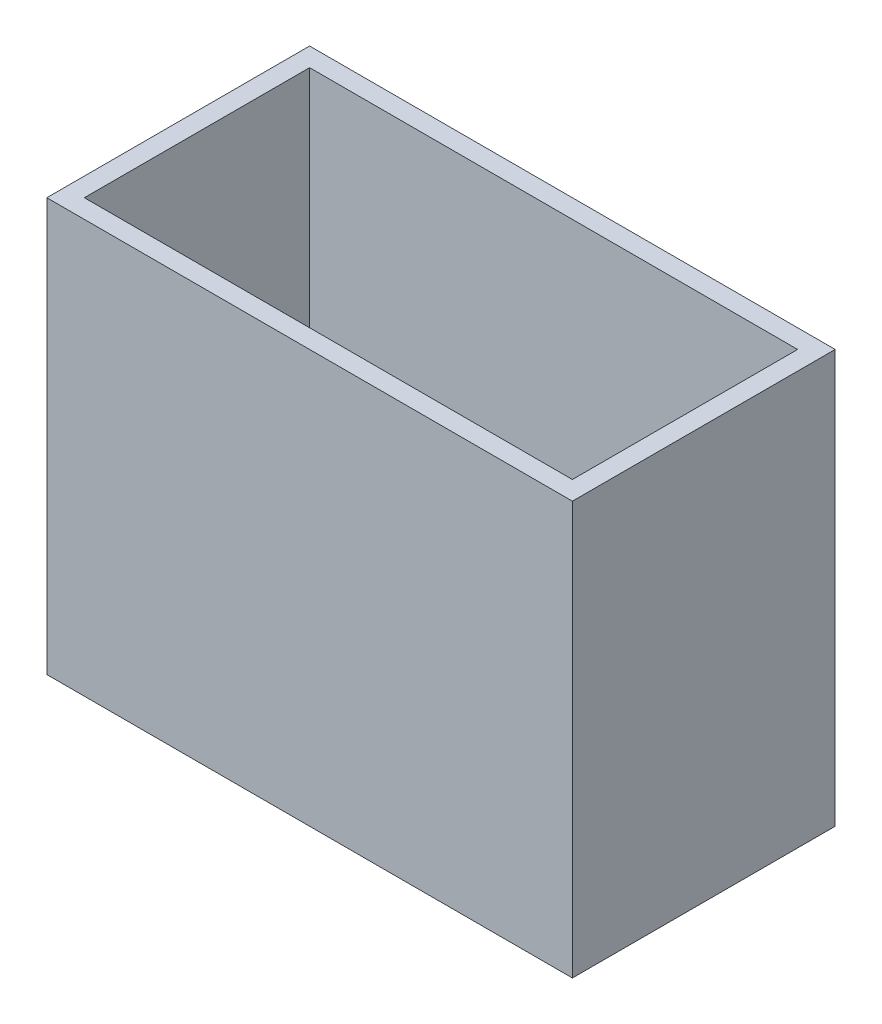
ISO-10303-21;
HEADER;
FILE_DESCRIPTION(('STEP AP214'),'2;1');
FILE_NAME('part.step','',(''),(''),'','','');
FILE_SCHEMA(('AUTOMOTIVE_DESIGN { 1 0 10303 214 1 1 1 1 }'));
ENDSEC;
DATA;
#1=APPLICATION_CONTEXT('core data for automotive mechanical design processes');
#2=APPLICATION_PROTOCOL_DEFINITION('international standard','automotive_design',2000,#1);
#3=PRODUCT_CONTEXT('',#1,'mechanical');
#4=PRODUCT('Part','Part','',(#3));
#5=PRODUCT_RELATED_PRODUCT_CATEGORY('part','',(#4));
#6=PRODUCT_DEFINITION_FORMATION('','',#4);
#7=PRODUCT_DEFINITION_CONTEXT('part definition',#1,'design');
#8=PRODUCT_DEFINITION('design','',#6,#7);
#9=PRODUCT_DEFINITION_SHAPE('','',#8);
#10=(LENGTH_UNIT() NAMED_UNIT(*) SI_UNIT(.MILLI.,.METRE.));
#11=(NAMED_UNIT(*) PLANE_ANGLE_UNIT() SI_UNIT($,.RADIAN.));
#12=(NAMED_UNIT(*) SI_UNIT($,.STERADIAN.) SOLID_ANGLE_UNIT());
#13=UNCERTAINTY_MEASURE_WITH_UNIT(LENGTH_MEASURE(1.E-05),#10,'distance_accuracy_value','');
#14=(GEOMETRIC_REPRESENTATION_CONTEXT(3) GLOBAL_UNCERTAINTY_ASSIGNED_CONTEXT((#13)) GLOBAL_UNIT_ASSIGNED_CONTEXT((#10,
#11,#12)) REPRESENTATION_CONTEXT('',''));
#15=CARTESIAN_POINT('',(0.,0.,0.));
#16=DIRECTION('',(0.,0.,1.));
#17=DIRECTION('',(1.,0.,0.));
#18=AXIS2_PLACEMENT_3D('',#15,#16,#17);
#19=CARTESIAN_POINT('',(0.,5.5,0.));
#20=DIRECTION('',(0.,1.,0.));
#21=DIRECTION('',(0.,0.,1.));
#22=AXIS2_PLACEMENT_3D('',#19,#20,#21);
#23=PLANE('',#22);
#24=DIRECTION('',(0.,0.,1.));
#25=VECTOR('',#24,1.);
#26=CARTESIAN_POINT('',(-7.,5.5,-3.5));
#27=LINE('',#26,#25);
#28=CARTESIAN_POINT('',(-7.,5.5,-3.5));
#29=VERTEX_POINT('',#28);
#30=CARTESIAN_POINT('',(-7.,5.5,3.5));
#31=VERTEX_POINT('',#30);
#32=EDGE_CURVE('E135',#29,#31,#27,.T.);
#33=ORIENTED_EDGE('',*,*,#32,.T.);
#34=DIRECTION('',(1.,0.,0.));
#35=VECTOR('',#34,1.);
#36=CARTESIAN_POINT('',(-7.,5.5,3.5));
#37=LINE('',#36,#35);
#38=CARTESIAN_POINT('',(7.,5.5,3.5));
#39=VERTEX_POINT('',#38);
#40=EDGE_CURVE('E138',#31,#39,#37,.T.);
#41=ORIENTED_EDGE('',*,*,#40,.T.);
#42=DIRECTION('',(0.,0.,-1.));
#43=VECTOR('',#42,1.);
#44=CARTESIAN_POINT('',(7.,5.5,-3.5));
#45=LINE('',#44,#43);
#46=CARTESIAN_POINT('',(7.,5.5,-3.5));
#47=VERTEX_POINT('',#46);
#48=EDGE_CURVE('E141',#39,#47,#45,.T.);
#49=ORIENTED_EDGE('',*,*,#48,.T.);
#50=DIRECTION('',(-1.,0.,0.));
#51=VECTOR('',#50,1.);
#52=CARTESIAN_POINT('',(-7.,5.5,-3.5));
#53=LINE('',#52,#51);
#54=EDGE_CURVE('E143',#47,#29,#53,.T.);
#55=ORIENTED_EDGE('',*,*,#54,.T.);
#56=EDGE_LOOP('',(#33,#41,#49,#55));
#57=FACE_BOUND('',#56,.T.);
#58=DIRECTION('',(1.,0.,0.));
#59=VECTOR('',#58,1.);
#60=CARTESIAN_POINT('',(-6.5,5.5,3.));
#61=LINE('',#60,#59);
#62=CARTESIAN_POINT('',(-6.5,5.5,3.));
#63=VERTEX_POINT('',#62);
#64=CARTESIAN_POINT('',(6.5,5.5,3.));
#65=VERTEX_POINT('',#64);
#66=EDGE_CURVE('E107',#63,#65,#61,.T.);
#67=ORIENTED_EDGE('',*,*,#66,.F.);
#68=DIRECTION('',(0.,0.,1.));
#69=VECTOR('',#68,1.);
#70=CARTESIAN_POINT('',(-6.5,5.5,-3.));
#71=LINE('',#70,#69);
#72=CARTESIAN_POINT('',(-6.5,5.5,-3.));
#73=VERTEX_POINT('',#72);
#74=EDGE_CURVE('E99',#73,#63,#71,.T.);
#75=ORIENTED_EDGE('',*,*,#74,.F.);
#76=DIRECTION('',(-1.,0.,0.));
#77=VECTOR('',#76,1.);
#78=CARTESIAN_POINT('',(-6.5,5.5,-3.));
#79=LINE('',#78,#77);
#80=CARTESIAN_POINT('',(6.5,5.5,-3.));
#81=VERTEX_POINT('',#80);
#82=EDGE_CURVE('E121',#81,#73,#79,.T.);
#83=ORIENTED_EDGE('',*,*,#82,.F.);
#84=DIRECTION('',(0.,0.,-1.));
#85=VECTOR('',#84,1.);
#86=CARTESIAN_POINT('',(6.5,5.5,-3.));
#87=LINE('',#86,#85);
#88=EDGE_CURVE('E119',#65,#81,#87,.T.);
#89=ORIENTED_EDGE('',*,*,#88,.F.);
#90=EDGE_LOOP('',(#67,#75,#83,#89));
#91=FACE_BOUND('',#90,.T.);
#92=ADVANCED_FACE('F34',(#57,#91),#23,.T.);
#93=CARTESIAN_POINT('',(0.,-5.5,0.));
#94=DIRECTION('',(0.,1.,0.));
#95=DIRECTION('',(0.,0.,1.));
#96=AXIS2_PLACEMENT_3D('',#93,#94,#95);
#97=PLANE('',#96);
#98=DIRECTION('',(0.,0.,1.));
#99=VECTOR('',#98,1.);
#100=CARTESIAN_POINT('',(-7.,-5.5,-3.5));
#101=LINE('',#100,#99);
#102=CARTESIAN_POINT('',(-7.,-5.5,-3.5));
#103=VERTEX_POINT('',#102);
#104=CARTESIAN_POINT('',(-7.,-5.5,3.5));
#105=VERTEX_POINT('',#104);
#106=EDGE_CURVE('E115',#103,#105,#101,.T.);
#107=ORIENTED_EDGE('',*,*,#106,.F.);
#108=DIRECTION('',(-1.,0.,0.));
#109=VECTOR('',#108,1.);
#110=CARTESIAN_POINT('',(-7.,-5.5,-3.5));
#111=LINE('',#110,#109);
#112=CARTESIAN_POINT('',(7.,-5.5,-3.5));
#113=VERTEX_POINT('',#112);
#114=EDGE_CURVE('E139',#113,#103,#111,.T.);
#115=ORIENTED_EDGE('',*,*,#114,.F.);
#116=DIRECTION('',(0.,0.,-1.));
#117=VECTOR('',#116,1.);
#118=CARTESIAN_POINT('',(7.,-5.5,-3.5));
#119=LINE('',#118,#117);
#120=CARTESIAN_POINT('',(7.,-5.5,3.5));
#121=VERTEX_POINT('',#120);
#122=EDGE_CURVE('E150',#121,#113,#119,.T.);
#123=ORIENTED_EDGE('',*,*,#122,.F.);
#124=DIRECTION('',(1.,0.,0.));
#125=VECTOR('',#124,1.);
#126=CARTESIAN_POINT('',(-7.,-5.5,3.5));
#127=LINE('',#126,#125);
#128=EDGE_CURVE('E148',#105,#121,#127,.T.);
#129=ORIENTED_EDGE('',*,*,#128,.F.);
#130=EDGE_LOOP('',(#107,#115,#123,#129));
#131=FACE_BOUND('',#130,.T.);
#132=DIRECTION('',(0.,0.,1.));
#133=VECTOR('',#132,1.);
#134=CARTESIAN_POINT('',(-6.5,-5.5,-3.));
#135=LINE('',#134,#133);
#136=CARTESIAN_POINT('',(-6.5,-5.5,-3.));
#137=VERTEX_POINT('',#136);
#138=CARTESIAN_POINT('',(-6.5,-5.5,3.));
#139=VERTEX_POINT('',#138);
#140=EDGE_CURVE('E57',#137,#139,#135,.T.);
#141=ORIENTED_EDGE('',*,*,#140,.T.);
#142=DIRECTION('',(1.,0.,0.));
#143=VECTOR('',#142,1.);
#144=CARTESIAN_POINT('',(-6.5,-5.5,3.));
#145=LINE('',#144,#143);
#146=CARTESIAN_POINT('',(6.5,-5.5,3.));
#147=VERTEX_POINT('',#146);
#148=EDGE_CURVE('E114',#139,#147,#145,.T.);
#149=ORIENTED_EDGE('',*,*,#148,.T.);
#150=DIRECTION('',(0.,0.,-1.));
#151=VECTOR('',#150,1.);
#152=CARTESIAN_POINT('',(6.5,-5.5,-3.));
#153=LINE('',#152,#151);
#154=CARTESIAN_POINT('',(6.5,-5.5,-3.));
#155=VERTEX_POINT('',#154);
#156=EDGE_CURVE('E127',#147,#155,#153,.T.);
#157=ORIENTED_EDGE('',*,*,#156,.T.);
#158=DIRECTION('',(-1.,0.,0.));
#159=VECTOR('',#158,1.);
#160=CARTESIAN_POINT('',(-6.5,-5.5,-3.));
#161=LINE('',#160,#159);
#162=EDGE_CURVE('E108',#155,#137,#161,.T.);
#163=ORIENTED_EDGE('',*,*,#162,.T.);
#164=EDGE_LOOP('',(#141,#149,#157,#163));
#165=FACE_BOUND('',#164,.T.);
#166=ADVANCED_FACE('F168',(#131,#165),#97,.F.);
#167=CARTESIAN_POINT('',(-7.,5.5,-3.5));
#168=DIRECTION('',(1.,0.,0.));
#169=DIRECTION('',(0.,0.,-1.));
#170=AXIS2_PLACEMENT_3D('',#167,#168,#169);
#171=PLANE('',#170);
#172=ORIENTED_EDGE('',*,*,#106,.T.);
#173=DIRECTION('',(0.,-1.,0.));
#174=VECTOR('',#173,1.);
#175=CARTESIAN_POINT('',(-7.,5.5,3.5));
#176=LINE('',#175,#174);
#177=EDGE_CURVE('E11',#31,#105,#176,.T.);
#178=ORIENTED_EDGE('',*,*,#177,.F.);
#179=ORIENTED_EDGE('',*,*,#32,.F.);
#180=DIRECTION('',(0.,-1.,0.));
#181=VECTOR('',#180,1.);
#182=CARTESIAN_POINT('',(-7.,5.5,-3.5));
#183=LINE('',#182,#181);
#184=EDGE_CURVE('E145',#29,#103,#183,.T.);
#185=ORIENTED_EDGE('',*,*,#184,.T.);
#186=EDGE_LOOP('',(#172,#178,#179,#185));
#187=FACE_BOUND('',#186,.T.);
#188=ADVANCED_FACE('F36',(#187),#171,.F.);
#189=CARTESIAN_POINT('',(-7.,5.5,3.5));
#190=DIRECTION('',(0.,0.,-1.));
#191=DIRECTION('',(-1.,0.,0.));
#192=AXIS2_PLACEMENT_3D('',#189,#190,#191);
#193=PLANE('',#192);
#194=ORIENTED_EDGE('',*,*,#128,.T.);
#195=DIRECTION('',(0.,-1.,0.));
#196=VECTOR('',#195,1.);
#197=CARTESIAN_POINT('',(7.,5.5,3.5));
#198=LINE('',#197,#196);
#199=EDGE_CURVE('E42',#39,#121,#198,.T.);
#200=ORIENTED_EDGE('',*,*,#199,.F.);
#201=ORIENTED_EDGE('',*,*,#40,.F.);
#202=ORIENTED_EDGE('',*,*,#177,.T.);
#203=EDGE_LOOP('',(#194,#200,#201,#202));
#204=FACE_BOUND('',#203,.T.);
#205=ADVANCED_FACE('F178',(#204),#193,.F.);
#206=CARTESIAN_POINT('',(7.,5.5,-3.5));
#207=DIRECTION('',(-1.,0.,0.));
#208=DIRECTION('',(0.,0.,1.));
#209=AXIS2_PLACEMENT_3D('',#206,#207,#208);
#210=PLANE('',#209);
#211=ORIENTED_EDGE('',*,*,#122,.T.);
#212=DIRECTION('',(0.,-1.,0.));
#213=VECTOR('',#212,1.);
#214=CARTESIAN_POINT('',(7.,5.5,-3.5));
#215=LINE('',#214,#213);
#216=EDGE_CURVE('E155',#47,#113,#215,.T.);
#217=ORIENTED_EDGE('',*,*,#216,.F.);
#218=ORIENTED_EDGE('',*,*,#48,.F.);
#219=ORIENTED_EDGE('',*,*,#199,.T.);
#220=EDGE_LOOP('',(#211,#217,#218,#219));
#221=FACE_BOUND('',#220,.T.);
#222=ADVANCED_FACE('F162',(#221),#210,.F.);
#223=CARTESIAN_POINT('',(-7.,5.5,-3.5));
#224=DIRECTION('',(0.,0.,1.));
#225=DIRECTION('',(1.,0.,0.));
#226=AXIS2_PLACEMENT_3D('',#223,#224,#225);
#227=PLANE('',#226);
#228=ORIENTED_EDGE('',*,*,#114,.T.);
#229=ORIENTED_EDGE('',*,*,#184,.F.);
#230=ORIENTED_EDGE('',*,*,#54,.F.);
#231=ORIENTED_EDGE('',*,*,#216,.T.);
#232=EDGE_LOOP('',(#228,#229,#230,#231));
#233=FACE_BOUND('',#232,.T.);
#234=ADVANCED_FACE('F172',(#233),#227,.F.);
#235=CARTESIAN_POINT('',(-6.5,5.5,-3.));
#236=DIRECTION('',(1.,0.,0.));
#237=DIRECTION('',(0.,0.,-1.));
#238=AXIS2_PLACEMENT_3D('',#235,#236,#237);
#239=PLANE('',#238);
#240=ORIENTED_EDGE('',*,*,#140,.F.);
#241=DIRECTION('',(0.,-1.,0.));
#242=VECTOR('',#241,1.);
#243=CARTESIAN_POINT('',(-6.5,5.5,-3.));
#244=LINE('',#243,#242);
#245=EDGE_CURVE('E103',#73,#137,#244,.T.);
#246=ORIENTED_EDGE('',*,*,#245,.F.);
#247=ORIENTED_EDGE('',*,*,#74,.T.);
#248=DIRECTION('',(0.,-1.,0.));
#249=VECTOR('',#248,1.);
#250=CARTESIAN_POINT('',(-6.5,5.5,3.));
#251=LINE('',#250,#249);
#252=EDGE_CURVE('E102',#63,#139,#251,.T.);
#253=ORIENTED_EDGE('',*,*,#252,.T.);
#254=EDGE_LOOP('',(#240,#246,#247,#253));
#255=FACE_BOUND('',#254,.T.);
#256=ADVANCED_FACE('F101',(#255),#239,.T.);
#257=CARTESIAN_POINT('',(-6.5,5.5,3.));
#258=DIRECTION('',(0.,0.,-1.));
#259=DIRECTION('',(-1.,0.,0.));
#260=AXIS2_PLACEMENT_3D('',#257,#258,#259);
#261=PLANE('',#260);
#262=ORIENTED_EDGE('',*,*,#148,.F.);
#263=ORIENTED_EDGE('',*,*,#252,.F.);
#264=ORIENTED_EDGE('',*,*,#66,.T.);
#265=DIRECTION('',(0.,-1.,0.));
#266=VECTOR('',#265,1.);
#267=CARTESIAN_POINT('',(6.5,5.5,3.));
#268=LINE('',#267,#266);
#269=EDGE_CURVE('E116',#65,#147,#268,.T.);
#270=ORIENTED_EDGE('',*,*,#269,.T.);
#271=EDGE_LOOP('',(#262,#263,#264,#270));
#272=FACE_BOUND('',#271,.T.);
#273=ADVANCED_FACE('F111',(#272),#261,.T.);
#274=CARTESIAN_POINT('',(6.5,5.5,-3.));
#275=DIRECTION('',(-1.,0.,0.));
#276=DIRECTION('',(0.,0.,1.));
#277=AXIS2_PLACEMENT_3D('',#274,#275,#276);
#278=PLANE('',#277);
#279=ORIENTED_EDGE('',*,*,#156,.F.);
#280=ORIENTED_EDGE('',*,*,#269,.F.);
#281=ORIENTED_EDGE('',*,*,#88,.T.);
#282=DIRECTION('',(0.,-1.,0.));
#283=VECTOR('',#282,1.);
#284=CARTESIAN_POINT('',(6.5,5.5,-3.));
#285=LINE('',#284,#283);
#286=EDGE_CURVE('E49',#81,#155,#285,.T.);
#287=ORIENTED_EDGE('',*,*,#286,.T.);
#288=EDGE_LOOP('',(#279,#280,#281,#287));
#289=FACE_BOUND('',#288,.T.);
#290=ADVANCED_FACE('F201',(#289),#278,.T.);
#291=CARTESIAN_POINT('',(-6.5,5.5,-3.));
#292=DIRECTION('',(0.,0.,1.));
#293=DIRECTION('',(1.,0.,0.));
#294=AXIS2_PLACEMENT_3D('',#291,#292,#293);
#295=PLANE('',#294);
#296=ORIENTED_EDGE('',*,*,#162,.F.);
#297=ORIENTED_EDGE('',*,*,#286,.F.);
#298=ORIENTED_EDGE('',*,*,#82,.T.);
#299=ORIENTED_EDGE('',*,*,#245,.T.);
#300=EDGE_LOOP('',(#296,#297,#298,#299));
#301=FACE_BOUND('',#300,.T.);
#302=ADVANCED_FACE('F205',(#301),#295,.T.);
#303=CLOSED_SHELL('',(#92,#166,#188,#205,#222,#234,#256,#273,#290,#302));
#304=MANIFOLD_SOLID_BREP('B2',#303);
#305=ADVANCED_BREP_SHAPE_REPRESENTATION('',(#18,#304),#14);
#306=SHAPE_DEFINITION_REPRESENTATION(#9,#305);
ENDSEC;
END-ISO-10303-21;
